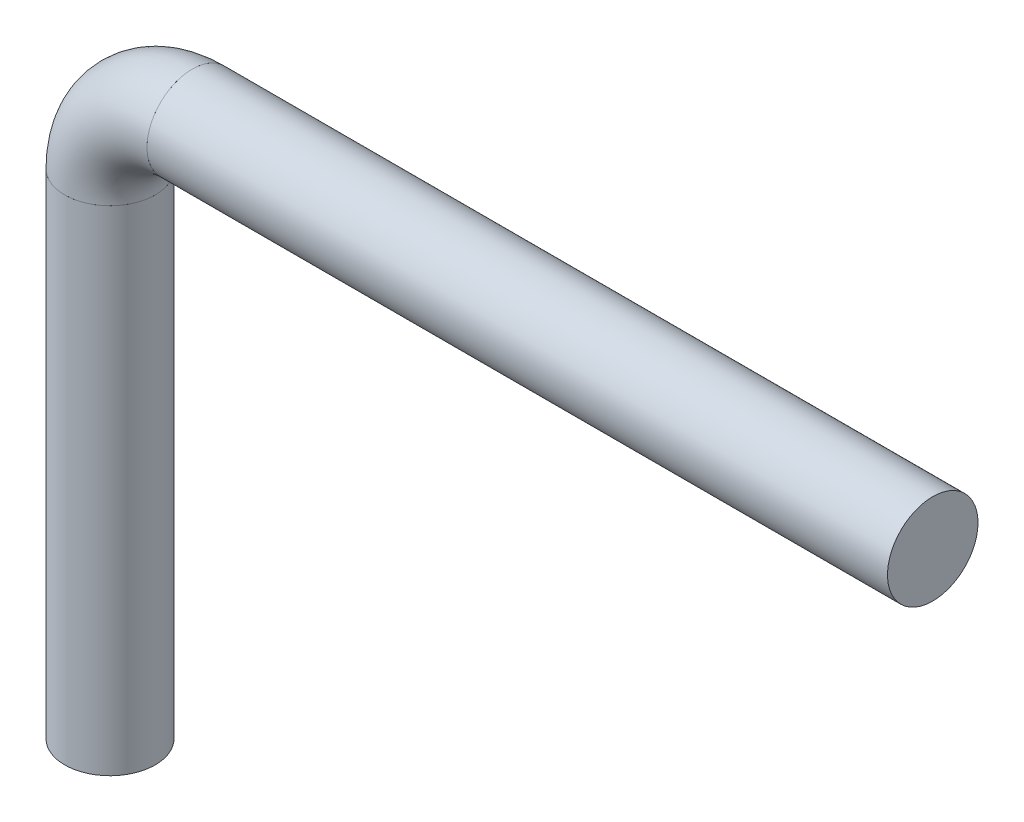
ISO-10303-21;
HEADER;
FILE_DESCRIPTION(('STEP AP214'),'2;1');
FILE_NAME('part.step','',(''),(''),'','','');
FILE_SCHEMA(('AUTOMOTIVE_DESIGN { 1 0 10303 214 1 1 1 1 }'));
ENDSEC;
DATA;
#1=APPLICATION_CONTEXT('core data for automotive mechanical design processes');
#2=APPLICATION_PROTOCOL_DEFINITION('international standard','automotive_design',2000,#1);
#3=PRODUCT_CONTEXT('',#1,'mechanical');
#4=PRODUCT('Part','Part','',(#3));
#5=PRODUCT_RELATED_PRODUCT_CATEGORY('part','',(#4));
#6=PRODUCT_DEFINITION_FORMATION('','',#4);
#7=PRODUCT_DEFINITION_CONTEXT('part definition',#1,'design');
#8=PRODUCT_DEFINITION('design','',#6,#7);
#9=PRODUCT_DEFINITION_SHAPE('','',#8);
#10=(LENGTH_UNIT() NAMED_UNIT(*) SI_UNIT(.MILLI.,.METRE.));
#11=(NAMED_UNIT(*) PLANE_ANGLE_UNIT() SI_UNIT($,.RADIAN.));
#12=(NAMED_UNIT(*) SI_UNIT($,.STERADIAN.) SOLID_ANGLE_UNIT());
#13=UNCERTAINTY_MEASURE_WITH_UNIT(LENGTH_MEASURE(1.E-05),#10,'distance_accuracy_value','');
#14=(GEOMETRIC_REPRESENTATION_CONTEXT(3) GLOBAL_UNCERTAINTY_ASSIGNED_CONTEXT((#13)) GLOBAL_UNIT_ASSIGNED_CONTEXT((#10,
#11,#12)) REPRESENTATION_CONTEXT('',''));
#15=CARTESIAN_POINT('',(0.,0.,0.));
#16=DIRECTION('',(0.,0.,1.));
#17=DIRECTION('',(1.,0.,0.));
#18=AXIS2_PLACEMENT_3D('',#15,#16,#17);
#19=CARTESIAN_POINT('',(0.999999999999999,6.,0.));
#20=DIRECTION('',(0.,0.,-1.));
#21=DIRECTION('',(-1.,0.,0.));
#22=AXIS2_PLACEMENT_3D('',#19,#20,#21);
#23=TOROIDAL_SURFACE('',#22,1.,0.55);
#24=CARTESIAN_POINT('',(0.,6.,0.));
#25=DIRECTION('',(0.,-1.,0.));
#26=DIRECTION('',(0.,0.,1.));
#27=AXIS2_PLACEMENT_3D('',#24,#25,#26);
#28=CIRCLE('',#27,0.55);
#29=CARTESIAN_POINT('',(-0.550000000000001,6.,0.));
#30=VERTEX_POINT('',#29);
#31=EDGE_CURVE('E11',#30,#30,#28,.T.);
#32=CARTESIAN_POINT('',(0.999999999999999,7.,0.));
#33=DIRECTION('',(-1.,0.,0.));
#34=DIRECTION('',(0.,0.,1.));
#35=AXIS2_PLACEMENT_3D('',#32,#33,#34);
#36=CIRCLE('',#35,0.55);
#37=CARTESIAN_POINT('',(0.999999999999999,7.55,0.));
#38=VERTEX_POINT('',#37);
#39=EDGE_CURVE('E54',#38,#38,#36,.T.);
#40=CARTESIAN_POINT('',(0.999999999999999,6.,0.));
#41=DIRECTION('',(0.,0.,-1.));
#42=DIRECTION('',(-1.,0.,0.));
#43=AXIS2_PLACEMENT_3D('',#40,#41,#42);
#44=CIRCLE('',#43,1.55);
#45=EDGE_CURVE('',#30,#38,#44,.T.);
#46=ORIENTED_EDGE('',*,*,#31,.F.);
#47=ORIENTED_EDGE('',*,*,#39,.T.);
#48=ORIENTED_EDGE('',*,*,#45,.T.);
#49=ORIENTED_EDGE('',*,*,#45,.F.);
#50=EDGE_LOOP('',(#46,#48,#47,#49));
#51=FACE_BOUND('',#50,.T.);
#52=ADVANCED_FACE('F48',(#51),#23,.T.);
#53=CARTESIAN_POINT('',(0.,6.,0.));
#54=DIRECTION('',(0.,-1.,0.));
#55=DIRECTION('',(0.,0.,1.));
#56=AXIS2_PLACEMENT_3D('',#53,#54,#55);
#57=PLANE('',#56);
#58=ORIENTED_EDGE('',*,*,#31,.T.);
#59=EDGE_LOOP('',(#58));
#60=FACE_BOUND('',#59,.T.);
#61=ADVANCED_FACE('F63',(#60),#57,.T.);
#62=CARTESIAN_POINT('',(0.999999999999999,7.,0.));
#63=DIRECTION('',(-1.,0.,0.));
#64=DIRECTION('',(0.,0.,1.));
#65=AXIS2_PLACEMENT_3D('',#62,#63,#64);
#66=PLANE('',#65);
#67=ORIENTED_EDGE('',*,*,#39,.F.);
#68=EDGE_LOOP('',(#67));
#69=FACE_BOUND('',#68,.T.);
#70=ADVANCED_FACE('F61',(#69),#66,.F.);
#71=CLOSED_SHELL('',(#52,#61,#70));
#72=MANIFOLD_SOLID_BREP('B2',#71);
#73=CARTESIAN_POINT('',(10.,7.,0.));
#74=DIRECTION('',(-1.,0.,0.));
#75=DIRECTION('',(0.,0.,1.));
#76=AXIS2_PLACEMENT_3D('',#73,#74,#75);
#77=CYLINDRICAL_SURFACE('',#76,0.55);
#78=CARTESIAN_POINT('',(10.,7.,0.));
#79=DIRECTION('',(1.,0.,0.));
#80=DIRECTION('',(0.,0.,-1.));
#81=AXIS2_PLACEMENT_3D('',#78,#79,#80);
#82=CIRCLE('',#81,0.55);
#83=CARTESIAN_POINT('',(10.,7.,-0.55));
#84=VERTEX_POINT('',#83);
#85=EDGE_CURVE('E47',#84,#84,#82,.T.);
#86=ORIENTED_EDGE('',*,*,#85,.F.);
#87=EDGE_LOOP('',(#86));
#88=FACE_BOUND('',#87,.T.);
#89=CARTESIAN_POINT('',(0.999999999999999,7.,0.));
#90=DIRECTION('',(1.,0.,0.));
#91=DIRECTION('',(0.,0.,-1.));
#92=AXIS2_PLACEMENT_3D('',#89,#90,#91);
#93=CIRCLE('',#92,0.55);
#94=CARTESIAN_POINT('',(0.999999999999999,7.,-0.55));
#95=VERTEX_POINT('',#94);
#96=EDGE_CURVE('E105',#95,#95,#93,.T.);
#97=ORIENTED_EDGE('',*,*,#96,.T.);
#98=EDGE_LOOP('',(#97));
#99=FACE_BOUND('',#98,.T.);
#100=ADVANCED_FACE('F102',(#88,#99),#77,.T.);
#101=CARTESIAN_POINT('',(10.,7.,0.));
#102=DIRECTION('',(1.,0.,0.));
#103=DIRECTION('',(0.,0.,-1.));
#104=AXIS2_PLACEMENT_3D('',#101,#102,#103);
#105=PLANE('',#104);
#106=ORIENTED_EDGE('',*,*,#85,.T.);
#107=EDGE_LOOP('',(#106));
#108=FACE_BOUND('',#107,.T.);
#109=ADVANCED_FACE('F117',(#108),#105,.T.);
#110=CARTESIAN_POINT('',(0.999999999999999,7.,0.));
#111=DIRECTION('',(1.,0.,0.));
#112=DIRECTION('',(0.,0.,-1.));
#113=AXIS2_PLACEMENT_3D('',#110,#111,#112);
#114=PLANE('',#113);
#115=ORIENTED_EDGE('',*,*,#96,.F.);
#116=EDGE_LOOP('',(#115));
#117=FACE_BOUND('',#116,.T.);
#118=ADVANCED_FACE('F115',(#117),#114,.F.);
#119=CLOSED_SHELL('',(#100,#109,#118));
#120=MANIFOLD_SOLID_BREP('B6',#119);
#121=CARTESIAN_POINT('',(0.,0.,0.));
#122=DIRECTION('',(0.,1.,0.));
#123=DIRECTION('',(0.,0.,1.));
#124=AXIS2_PLACEMENT_3D('',#121,#122,#123);
#125=CYLINDRICAL_SURFACE('',#124,0.55);
#126=CARTESIAN_POINT('',(0.,0.,0.));
#127=DIRECTION('',(0.,-1.,0.));
#128=DIRECTION('',(0.,0.,-1.));
#129=AXIS2_PLACEMENT_3D('',#126,#127,#128);
#130=CIRCLE('',#129,0.55);
#131=CARTESIAN_POINT('',(0.,0.,-0.55));
#132=VERTEX_POINT('',#131);
#133=EDGE_CURVE('E101',#132,#132,#130,.T.);
#134=ORIENTED_EDGE('',*,*,#133,.F.);
#135=EDGE_LOOP('',(#134));
#136=FACE_BOUND('',#135,.T.);
#137=CARTESIAN_POINT('',(0.,6.,0.));
#138=DIRECTION('',(0.,-1.,0.));
#139=DIRECTION('',(0.,0.,-1.));
#140=AXIS2_PLACEMENT_3D('',#137,#138,#139);
#141=CIRCLE('',#140,0.55);
#142=CARTESIAN_POINT('',(0.,6.,-0.55));
#143=VERTEX_POINT('',#142);
#144=EDGE_CURVE('E152',#143,#143,#141,.T.);
#145=ORIENTED_EDGE('',*,*,#144,.T.);
#146=EDGE_LOOP('',(#145));
#147=FACE_BOUND('',#146,.T.);
#148=ADVANCED_FACE('F149',(#136,#147),#125,.T.);
#149=CARTESIAN_POINT('',(0.,0.,0.));
#150=DIRECTION('',(0.,-1.,0.));
#151=DIRECTION('',(0.,0.,-1.));
#152=AXIS2_PLACEMENT_3D('',#149,#150,#151);
#153=PLANE('',#152);
#154=ORIENTED_EDGE('',*,*,#133,.T.);
#155=EDGE_LOOP('',(#154));
#156=FACE_BOUND('',#155,.T.);
#157=ADVANCED_FACE('F164',(#156),#153,.T.);
#158=CARTESIAN_POINT('',(0.,6.,0.));
#159=DIRECTION('',(0.,-1.,0.));
#160=DIRECTION('',(0.,0.,-1.));
#161=AXIS2_PLACEMENT_3D('',#158,#159,#160);
#162=PLANE('',#161);
#163=ORIENTED_EDGE('',*,*,#144,.F.);
#164=EDGE_LOOP('',(#163));
#165=FACE_BOUND('',#164,.T.);
#166=ADVANCED_FACE('F162',(#165),#162,.F.);
#167=CLOSED_SHELL('',(#148,#157,#166));
#168=MANIFOLD_SOLID_BREP('B42',#167);
#169=ADVANCED_BREP_SHAPE_REPRESENTATION('',(#18,#72,#120,#168),#14);
#170=SHAPE_DEFINITION_REPRESENTATION(#9,#169);
ENDSEC;
END-ISO-10303-21;
